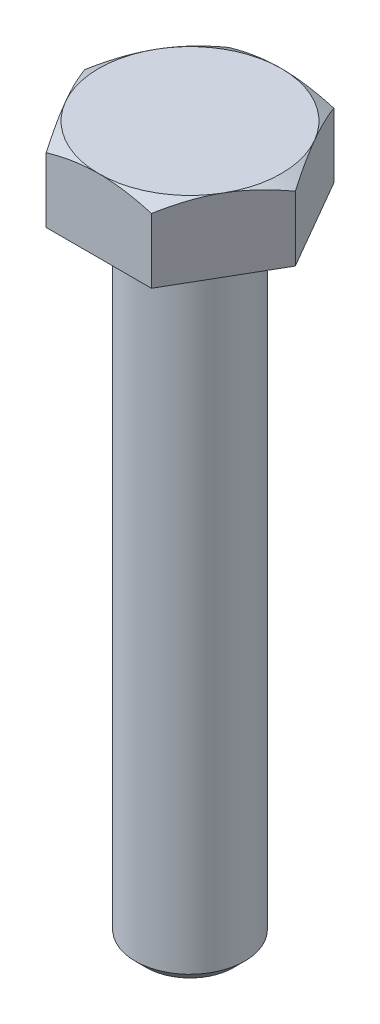
ISO-10303-21;
HEADER;
FILE_DESCRIPTION(('STEP AP214'),'2;1');
FILE_NAME('part.step','',(''),(''),'','','');
FILE_SCHEMA(('AUTOMOTIVE_DESIGN { 1 0 10303 214 1 1 1 1 }'));
ENDSEC;
DATA;
#1=APPLICATION_CONTEXT('core data for automotive mechanical design processes');
#2=APPLICATION_PROTOCOL_DEFINITION('international standard','automotive_design',2000,#1);
#3=PRODUCT_CONTEXT('',#1,'mechanical');
#4=PRODUCT('Part','Part','',(#3));
#5=PRODUCT_RELATED_PRODUCT_CATEGORY('part','',(#4));
#6=PRODUCT_DEFINITION_FORMATION('','',#4);
#7=PRODUCT_DEFINITION_CONTEXT('part definition',#1,'design');
#8=PRODUCT_DEFINITION('design','',#6,#7);
#9=PRODUCT_DEFINITION_SHAPE('','',#8);
#10=(LENGTH_UNIT() NAMED_UNIT(*) SI_UNIT(.MILLI.,.METRE.));
#11=(NAMED_UNIT(*) PLANE_ANGLE_UNIT() SI_UNIT($,.RADIAN.));
#12=(NAMED_UNIT(*) SI_UNIT($,.STERADIAN.) SOLID_ANGLE_UNIT());
#13=UNCERTAINTY_MEASURE_WITH_UNIT(LENGTH_MEASURE(1.E-05),#10,'distance_accuracy_value','');
#14=(GEOMETRIC_REPRESENTATION_CONTEXT(3) GLOBAL_UNCERTAINTY_ASSIGNED_CONTEXT((#13)) GLOBAL_UNIT_ASSIGNED_CONTEXT((#10,
#11,#12)) REPRESENTATION_CONTEXT('',''));
#15=CARTESIAN_POINT('',(0.,0.,0.));
#16=DIRECTION('',(0.,0.,1.));
#17=DIRECTION('',(1.,0.,0.));
#18=AXIS2_PLACEMENT_3D('',#15,#16,#17);
#19=CARTESIAN_POINT('',(0.,0.,0.));
#20=DIRECTION('',(0.,1.,0.));
#21=DIRECTION('',(0.,0.,1.));
#22=AXIS2_PLACEMENT_3D('',#19,#20,#21);
#23=PLANE('',#22);
#24=CARTESIAN_POINT('',(0.,0.,0.));
#25=DIRECTION('',(0.,1.,0.));
#26=DIRECTION('',(0.,0.,1.));
#27=AXIS2_PLACEMENT_3D('',#24,#25,#26);
#28=CIRCLE('',#27,3.);
#29=CARTESIAN_POINT('',(0.,0.,3.));
#30=VERTEX_POINT('',#29);
#31=EDGE_CURVE('E185',#30,#30,#28,.T.);
#32=ORIENTED_EDGE('',*,*,#31,.T.);
#33=EDGE_LOOP('',(#32));
#34=FACE_BOUND('',#33,.T.);
#35=DIRECTION('',(0.499999999999997,0.,0.86602540378444));
#36=VECTOR('',#35,1.);
#37=CARTESIAN_POINT('',(2.88675134594814,0.,-5.));
#38=LINE('',#37,#36);
#39=CARTESIAN_POINT('',(2.88675134594814,0.,-5.));
#40=VERTEX_POINT('',#39);
#41=CARTESIAN_POINT('',(5.77350269189625,0.,0.));
#42=VERTEX_POINT('',#41);
#43=EDGE_CURVE('E122',#40,#42,#38,.T.);
#44=ORIENTED_EDGE('',*,*,#43,.T.);
#45=DIRECTION('',(-0.499999999999997,0.,0.86602540378444));
#46=VECTOR('',#45,1.);
#47=CARTESIAN_POINT('',(2.88675134594814,0.,5.));
#48=LINE('',#47,#46);
#49=CARTESIAN_POINT('',(2.88675134594814,0.,5.));
#50=VERTEX_POINT('',#49);
#51=EDGE_CURVE('E120',#42,#50,#48,.T.);
#52=ORIENTED_EDGE('',*,*,#51,.T.);
#53=DIRECTION('',(-1.,0.,0.));
#54=VECTOR('',#53,1.);
#55=CARTESIAN_POINT('',(-2.88675134594814,0.,5.));
#56=LINE('',#55,#54);
#57=CARTESIAN_POINT('',(-2.88675134594814,0.,5.));
#58=VERTEX_POINT('',#57);
#59=EDGE_CURVE('E50',#50,#58,#56,.T.);
#60=ORIENTED_EDGE('',*,*,#59,.T.);
#61=DIRECTION('',(-0.499999999999997,0.,-0.86602540378444));
#62=VECTOR('',#61,1.);
#63=CARTESIAN_POINT('',(-2.88675134594814,0.,5.));
#64=LINE('',#63,#62);
#65=CARTESIAN_POINT('',(-5.77350269189626,0.,0.));
#66=VERTEX_POINT('',#65);
#67=EDGE_CURVE('E109',#58,#66,#64,.T.);
#68=ORIENTED_EDGE('',*,*,#67,.T.);
#69=DIRECTION('',(0.499999999999997,0.,-0.86602540378444));
#70=VECTOR('',#69,1.);
#71=CARTESIAN_POINT('',(-2.88675134594814,0.,-5.00000000000001));
#72=LINE('',#71,#70);
#73=CARTESIAN_POINT('',(-2.88675134594814,0.,-5.00000000000001));
#74=VERTEX_POINT('',#73);
#75=EDGE_CURVE('E115',#66,#74,#72,.T.);
#76=ORIENTED_EDGE('',*,*,#75,.T.);
#77=DIRECTION('',(1.,0.,0.));
#78=VECTOR('',#77,1.);
#79=CARTESIAN_POINT('',(-2.88675134594814,0.,-5.00000000000001));
#80=LINE('',#79,#78);
#81=EDGE_CURVE('E127',#74,#40,#80,.T.);
#82=ORIENTED_EDGE('',*,*,#81,.T.);
#83=EDGE_LOOP('',(#44,#52,#60,#68,#76,#82));
#84=FACE_BOUND('',#83,.T.);
#85=ADVANCED_FACE('F27',(#34,#84),#23,.F.);
#86=CARTESIAN_POINT('',(0.,-35.,0.));
#87=DIRECTION('',(0.,1.,0.));
#88=DIRECTION('',(0.,0.,1.));
#89=AXIS2_PLACEMENT_3D('',#86,#87,#88);
#90=CYLINDRICAL_SURFACE('',#89,3.);
#91=CARTESIAN_POINT('',(0.,-34.4,0.));
#92=DIRECTION('',(0.,1.,0.));
#93=DIRECTION('',(0.,0.,1.));
#94=AXIS2_PLACEMENT_3D('',#91,#92,#93);
#95=CIRCLE('',#94,3.);
#96=CARTESIAN_POINT('',(0.,-34.4,3.));
#97=VERTEX_POINT('',#96);
#98=EDGE_CURVE('E35',#97,#97,#95,.T.);
#99=ORIENTED_EDGE('',*,*,#98,.T.);
#100=EDGE_LOOP('',(#99));
#101=FACE_BOUND('',#100,.T.);
#102=ORIENTED_EDGE('',*,*,#31,.F.);
#103=EDGE_LOOP('',(#102));
#104=FACE_BOUND('',#103,.T.);
#105=ADVANCED_FACE('F29',(#101,#104),#90,.T.);
#106=CARTESIAN_POINT('',(0.,-35.,0.));
#107=DIRECTION('',(0.,1.,0.));
#108=DIRECTION('',(0.,0.,1.));
#109=AXIS2_PLACEMENT_3D('',#106,#107,#108);
#110=PLANE('',#109);
#111=CARTESIAN_POINT('',(0.,-35.,0.));
#112=DIRECTION('',(0.,1.,0.));
#113=DIRECTION('',(0.,0.,1.));
#114=AXIS2_PLACEMENT_3D('',#111,#112,#113);
#115=CIRCLE('',#114,2.4);
#116=CARTESIAN_POINT('',(0.,-35.,2.4));
#117=VERTEX_POINT('',#116);
#118=EDGE_CURVE('E11',#117,#117,#115,.F.);
#119=ORIENTED_EDGE('',*,*,#118,.T.);
#120=EDGE_LOOP('',(#119));
#121=FACE_BOUND('',#120,.T.);
#122=ADVANCED_FACE('F195',(#121),#110,.F.);
#123=CARTESIAN_POINT('',(0.,-34.4,0.));
#124=DIRECTION('',(0.,1.,0.));
#125=DIRECTION('',(0.,0.,1.));
#126=AXIS2_PLACEMENT_3D('',#123,#124,#125);
#127=CONICAL_SURFACE('',#126,3.,0.785398163397443);
#128=ORIENTED_EDGE('',*,*,#118,.F.);
#129=EDGE_LOOP('',(#128));
#130=FACE_BOUND('',#129,.T.);
#131=ORIENTED_EDGE('',*,*,#98,.F.);
#132=EDGE_LOOP('',(#131));
#133=FACE_BOUND('',#132,.T.);
#134=ADVANCED_FACE('F165',(#130,#133),#127,.T.);
#135=CARTESIAN_POINT('',(2.88675134594814,4.00000000000001,-5.));
#136=DIRECTION('',(0.86602540378444,0.,-0.499999999999997));
#137=DIRECTION('',(-0.499999999999997,0.,-0.86602540378444));
#138=AXIS2_PLACEMENT_3D('',#135,#136,#137);
#139=PLANE('',#138);
#140=CARTESIAN_POINT('',(2.8866358758943,3.55335134394816,-5.00019999999999));
#141=CARTESIAN_POINT('',(3.01349970319369,3.62661343236236,-4.78046540547481));
#142=CARTESIAN_POINT('',(3.1414485999385,3.6932486780819,-4.55885141554041));
#143=CARTESIAN_POINT('',(3.39956193532122,3.80956100898919,-4.11178600454648));
#144=CARTESIAN_POINT('',(3.52973095989719,3.85919695008421,-3.88632664040922));
#145=CARTESIAN_POINT('',(3.78847564779799,3.9364489745813,-3.43816769477648));
#146=CARTESIAN_POINT('',(3.91701101576053,3.96457962171651,-3.2155379068958));
#147=CARTESIAN_POINT('',(4.11026620624323,3.98980507804631,-2.88081009815335));
#148=CARTESIAN_POINT('',(4.17472868879311,3.99538654023051,-2.76915780319493));
#149=CARTESIAN_POINT('',(4.30371322717528,4.00079778324853,-2.54575002932619));
#150=CARTESIAN_POINT('',(4.3682352811059,4.0006277417418,-2.43399455370967));
#151=CARTESIAN_POINT('',(4.54500768479195,3.99224636820796,-2.12781576914935));
#152=CARTESIAN_POINT('',(4.65719946015293,3.97817022810275,-1.93349391403277));
#153=CARTESIAN_POINT('',(4.88083840557981,3.93353474289057,-1.54613989800228));
#154=CARTESIAN_POINT('',(4.9922847895602,3.90296013985249,-1.35310909862842));
#155=CARTESIAN_POINT('',(5.21637431361295,3.82653150637884,-0.964974657525136));
#156=CARTESIAN_POINT('',(5.32898917185758,3.78035362112132,-0.769920001358256));
#157=CARTESIAN_POINT('',(5.55253939626497,3.67554820550807,-0.382719654641225));
#158=CARTESIAN_POINT('',(5.66347762579591,3.61694529656263,-0.190569004591907));
#159=CARTESIAN_POINT('',(5.77361816195009,3.55335134394817,0.000200000000005751));
#160=B_SPLINE_CURVE_WITH_KNOTS('',3,(#140,#141,#142,#143,#144,#145,#146,#147,#148,#149,#150,
#151,#152,#153,#154,#155,#156,#157,#158,#159),.UNSPECIFIED.,.F.,.F.,(4,2,2,2,2,2,2,2,2,4),(0.,
0.792555841363093,1.58701660053334,2.36181537487281,2.74884076077326,3.13585419177296,
3.80962362599679,4.48401723901189,5.17336882348928,5.86136694793724),.UNSPECIFIED.);
#161=CARTESIAN_POINT('',(2.88675134594814,3.55341801261479,-5.));
#162=VERTEX_POINT('',#161);
#163=CARTESIAN_POINT('',(4.3301270189222,4.,-2.49999999999998));
#164=VERTEX_POINT('',#163);
#165=EDGE_CURVE('E174',#162,#164,#160,.T.);
#166=ORIENTED_EDGE('',*,*,#165,.T.);
#167=CARTESIAN_POINT('',(5.77350269189625,3.5534180126148,0.));
#168=VERTEX_POINT('',#167);
#169=EDGE_CURVE('E168',#164,#168,#160,.T.);
#170=ORIENTED_EDGE('',*,*,#169,.T.);
#171=DIRECTION('',(0.,-1.,0.));
#172=VECTOR('',#171,1.);
#173=CARTESIAN_POINT('',(5.77350269189625,4.,0.));
#174=LINE('',#173,#172);
#175=EDGE_CURVE('E130',#168,#42,#174,.T.);
#176=ORIENTED_EDGE('',*,*,#175,.T.);
#177=ORIENTED_EDGE('',*,*,#43,.F.);
#178=DIRECTION('',(0.,-1.,0.));
#179=VECTOR('',#178,1.);
#180=CARTESIAN_POINT('',(2.88675134594814,4.00000000000001,-5.));
#181=LINE('',#180,#179);
#182=EDGE_CURVE('E131',#162,#40,#181,.T.);
#183=ORIENTED_EDGE('',*,*,#182,.F.);
#184=EDGE_LOOP('',(#166,#170,#176,#177,#183));
#185=FACE_BOUND('',#184,.T.);
#186=ADVANCED_FACE('F161',(#185),#139,.T.);
#187=CARTESIAN_POINT('',(-2.88675134594814,4.00000000000001,-5.00000000000001));
#188=DIRECTION('',(0.,0.,-1.));
#189=DIRECTION('',(-1.,0.,0.));
#190=AXIS2_PLACEMENT_3D('',#187,#188,#189);
#191=PLANE('',#190);
#192=CARTESIAN_POINT('',(-7.76048778926928,1.55679916581875,-5.));
#193=CARTESIAN_POINT('',(-7.5420565118467,1.66278331896011,-5.00000000000001));
#194=CARTESIAN_POINT('',(-7.32312449793921,1.76775310218603,-5.00000000000001));
#195=CARTESIAN_POINT('',(-6.88399274574952,1.97509357450427,-5.00000000000001));
#196=CARTESIAN_POINT('',(-6.66379281488742,2.07746385526996,-5.00000000000001));
#197=CARTESIAN_POINT('',(-6.22072743215021,2.27954865582134,-5.00000000000001));
#198=CARTESIAN_POINT('',(-5.99785399914674,2.37924573751646,-5.00000000000001));
#199=CARTESIAN_POINT('',(-5.55033674248157,2.57456857355314,-5.00000000000001));
#200=CARTESIAN_POINT('',(-5.32569300285983,2.67019451979615,-5.00000000000001));
#201=CARTESIAN_POINT('',(-4.86699252185332,2.85930406454707,-5.00000000000001));
#202=CARTESIAN_POINT('',(-4.63286588890892,2.95261905937791,-5.00000000000001));
#203=CARTESIAN_POINT('',(-4.16187574649591,3.13220189831135,-5.00000000000001));
#204=CARTESIAN_POINT('',(-3.92501193357261,3.21846895232746,-5.00000000000001));
#205=CARTESIAN_POINT('',(-3.44861200910271,3.38169583923859,-5.00000000000001));
#206=CARTESIAN_POINT('',(-3.20908240013027,3.45867446048014,-5.00000000000001));
#207=CARTESIAN_POINT('',(-2.72658707549266,3.60085841460941,-5.00000000000001));
#208=CARTESIAN_POINT('',(-2.48362246620479,3.66606744921734,-5.));
#209=CARTESIAN_POINT('',(-1.99547492809798,3.78123809132251,-5.));
#210=CARTESIAN_POINT('',(-1.7503120052408,3.83128293361866,-5.00000000000001));
#211=CARTESIAN_POINT('',(-1.25693040330865,3.91330313759114,-5.00000000000001));
#212=CARTESIAN_POINT('',(-1.00871201664547,3.94528021484797,-5.00000000000001));
#213=CARTESIAN_POINT('',(-0.513703870190963,3.98819571375164,-5.00000000000001));
#214=CARTESIAN_POINT('',(-0.266938190301912,3.99940504145542,-5.00000000000001));
#215=CARTESIAN_POINT('',(0.226662621341122,4.00054813207997,-5.));
#216=CARTESIAN_POINT('',(0.47349775423874,3.9904815213461,-4.99999999999999));
#217=CARTESIAN_POINT('',(0.892367264144084,3.95605849611754,-4.99999999999999));
#218=CARTESIAN_POINT('',(1.06484900611664,3.93683281467063,-5.));
#219=CARTESIAN_POINT('',(1.40854643072639,3.88918623589597,-5.00000000000001));
#220=CARTESIAN_POINT('',(1.57976193868589,3.86076409325046,-5.00000000000001));
#221=CARTESIAN_POINT('',(2.09128374091837,3.763197156301,-5.00000000000001));
#222=CARTESIAN_POINT('',(2.42927319835488,3.68176973611523,-5.00000000000001));
#223=CARTESIAN_POINT('',(2.93465289665546,3.54061970789696,-5.00000000000001));
#224=CARTESIAN_POINT('',(3.10466426762807,3.48974775564269,-5.00000000000001));
#225=CARTESIAN_POINT('',(3.44303543484803,3.38273154853344,-5.00000000000001));
#226=CARTESIAN_POINT('',(3.61139522026247,3.32658725912223,-5.00000000000001));
#227=CARTESIAN_POINT('',(3.94651663548223,3.20992638126615,-5.00000000000001));
#228=CARTESIAN_POINT('',(4.11327877489048,3.14941124341302,-5.00000000000001));
#229=CARTESIAN_POINT('',(4.44542232252997,3.02471944648924,-5.00000000000001));
#230=CARTESIAN_POINT('',(4.6108037462888,2.96054282865949,-5.));
#231=CARTESIAN_POINT('',(4.9983678843583,2.80599622987765,-5.));
#232=CARTESIAN_POINT('',(5.22004493155315,2.714360568402,-5.00000000000001));
#233=CARTESIAN_POINT('',(5.66153030335629,2.52668097806057,-5.00000000000001));
#234=CARTESIAN_POINT('',(5.88133851780496,2.43063679143738,-5.00000000000001));
#235=CARTESIAN_POINT('',(6.31942671713667,2.23501814306471,-5.00000000000001));
#236=CARTESIAN_POINT('',(6.53770638957655,2.13544298341336,-5.00000000000001));
#237=CARTESIAN_POINT('',(6.97295214936624,1.93345780770434,-5.00000000000001));
#238=CARTESIAN_POINT('',(7.18991820890859,1.83104773188916,-5.00000000000001));
#239=CARTESIAN_POINT('',(7.83959406167255,1.52018400970472,-5.00000000000001));
#240=CARTESIAN_POINT('',(8.27065630656694,1.30828938790695,-5.00000000000001));
#241=CARTESIAN_POINT('',(9.12966564235016,0.878278075997001,-5.00000000000001));
#242=CARTESIAN_POINT('',(9.55761261856338,0.660161158276192,-5.00000000000001));
#243=CARTESIAN_POINT('',(10.1800967721103,0.338805868079967,-5.00000000000001));
#244=CARTESIAN_POINT('',(10.3755404122209,0.2373182183117,-5.00000000000001));
#245=CARTESIAN_POINT('',(10.7660006843461,0.0335333766308003,-5.00000000000001));
#246=CARTESIAN_POINT('',(10.9610173241066,-0.0687638004388765,-5.00000000000001));
#247=CARTESIAN_POINT('',(11.545529921535,-0.376714641942765,-5.00000000000001));
#248=CARTESIAN_POINT('',(11.9344722683259,-0.583419183869823,-5.00000000000001));
#249=CARTESIAN_POINT('',(12.7102557093995,-0.998453048036567,-5.00000000000001));
#250=CARTESIAN_POINT('',(13.0970996194284,-1.20677711692846,-5.00000000000001));
#251=CARTESIAN_POINT('',(13.8698511096838,-1.62510517694811,-5.00000000000001));
#252=CARTESIAN_POINT('',(14.2557587399382,-1.83510907562157,-5.));
#253=CARTESIAN_POINT('',(14.6413209053525,-2.04574136052357,-4.99999999999999));
#254=B_SPLINE_CURVE_WITH_KNOTS('',3,(#192,#193,#194,#195,#196,#197,#198,#199,#200,#201,#202,
#203,#204,#205,#206,#207,#208,#209,#210,#211,#212,#213,#214,#215,#216,#217,#218,#219,#220,#221,
#222,#223,#224,#225,#226,#227,#228,#229,#230,#231,#232,#233,#234,#235,#236,#237,#238,#239,#240,
#241,#242,#243,#244,#245,#246,#247,#248,#249,#250,#251,#252,#253),.UNSPECIFIED.,.F.,.F.,(4,2,2,
2,2,2,2,2,2,2,2,2,2,2,2,2,2,2,2,2,2,2,2,2,2,2,2,2,2,2,4),(0.,0.728365768559899,1.45684524890932,
2.18928016612498,2.92168052018108,3.67770572085789,4.43381555732172,5.18836936553261,
5.94268543957441,6.69278284280357,7.44280901039121,8.18298060384632,8.92316519653325,
9.44356259764435,9.96403049669095,11.0055425058991,11.5378755676847,12.0702121187586,
12.602372803317,13.1345274950934,13.8540746977697,14.573664024613,15.2933963808733,
16.0131439200198,17.4540389903029,18.8949868355966,19.5556528539249,20.2163067866563,
21.5376696779227,22.8557792684195,24.1738168053778),.UNSPECIFIED.);
#255=CARTESIAN_POINT('',(-2.88675134594814,3.55341801261479,-5.00000000000001));
#256=VERTEX_POINT('',#255);
#257=CARTESIAN_POINT('',(0.,4.00000000000001,-5.00000000000001));
#258=VERTEX_POINT('',#257);
#259=EDGE_CURVE('E175',#256,#258,#254,.T.);
#260=ORIENTED_EDGE('',*,*,#259,.T.);
#261=EDGE_CURVE('E176',#258,#162,#254,.T.);
#262=ORIENTED_EDGE('',*,*,#261,.T.);
#263=ORIENTED_EDGE('',*,*,#182,.T.);
#264=ORIENTED_EDGE('',*,*,#81,.F.);
#265=DIRECTION('',(0.,-1.,0.));
#266=VECTOR('',#265,1.);
#267=CARTESIAN_POINT('',(-2.88675134594814,4.00000000000001,-5.00000000000001));
#268=LINE('',#267,#266);
#269=EDGE_CURVE('E134',#256,#74,#268,.T.);
#270=ORIENTED_EDGE('',*,*,#269,.F.);
#271=EDGE_LOOP('',(#260,#262,#263,#264,#270));
#272=FACE_BOUND('',#271,.T.);
#273=ADVANCED_FACE('F164',(#272),#191,.T.);
#274=CARTESIAN_POINT('',(-2.88675134594814,4.00000000000001,-5.00000000000001));
#275=DIRECTION('',(-0.86602540378444,0.,-0.499999999999997));
#276=DIRECTION('',(-0.499999999999997,0.,0.86602540378444));
#277=AXIS2_PLACEMENT_3D('',#274,#275,#276);
#278=PLANE('',#277);
#279=CARTESIAN_POINT('',(-5.77361816195008,3.55335134394823,0.000200000000005751));
#280=CARTESIAN_POINT('',(-5.64675433465069,3.62661343236239,-0.219534594525189));
#281=CARTESIAN_POINT('',(-5.51880543790589,3.69324867808192,-0.441148584459588));
#282=CARTESIAN_POINT('',(-5.26069210252317,3.80956100898918,-0.888213995453521));
#283=CARTESIAN_POINT('',(-5.13052307794721,3.85919695008421,-1.11367335959078));
#284=CARTESIAN_POINT('',(-4.87177839004641,3.9364489745813,-1.56183230522351));
#285=CARTESIAN_POINT('',(-4.74324302208387,3.96457962171651,-1.78446209310419));
#286=CARTESIAN_POINT('',(-4.54998783160116,3.98980507804631,-2.11918990184664));
#287=CARTESIAN_POINT('',(-4.48552534905128,3.99538654023051,-2.23084219680506));
#288=CARTESIAN_POINT('',(-4.35654081066911,4.00079778324853,-2.4542499706738));
#289=CARTESIAN_POINT('',(-4.2920187567385,4.0006277417418,-2.56600544629031));
#290=CARTESIAN_POINT('',(-4.11524635305245,3.99224636820796,-2.87218423085064));
#291=CARTESIAN_POINT('',(-4.00305457769147,3.97817022810274,-3.06650608596721));
#292=CARTESIAN_POINT('',(-3.77941563226458,3.93353474289056,-3.45386010199771));
#293=CARTESIAN_POINT('',(-3.66796924828419,3.90296013985248,-3.64689090137158));
#294=CARTESIAN_POINT('',(-3.44387972423144,3.82653150637883,-4.03502534247486));
#295=CARTESIAN_POINT('',(-3.33126486598681,3.78035362112131,-4.23007999864174));
#296=CARTESIAN_POINT('',(-3.10771464157941,3.67554820550806,-4.61728034535878));
#297=CARTESIAN_POINT('',(-2.99677641204848,3.61694529656262,-4.8094309954081));
#298=CARTESIAN_POINT('',(-2.8866358758943,3.55335134394816,-5.00020000000001));
#299=B_SPLINE_CURVE_WITH_KNOTS('',3,(#279,#280,#281,#282,#283,#284,#285,#286,#287,#288,#289,
#290,#291,#292,#293,#294,#295,#296,#297,#298),.UNSPECIFIED.,.F.,.F.,(4,2,2,2,2,2,2,2,2,4),(0.,
0.792555841363082,1.58701660053332,2.36181537487279,2.74884076077323,3.13585419177293,
3.80962362599677,4.48401723901187,5.17336882348927,5.86136694793724),.UNSPECIFIED.);
#300=CARTESIAN_POINT('',(-5.77350269189626,3.55341801261486,0.));
#301=VERTEX_POINT('',#300);
#302=CARTESIAN_POINT('',(-4.3301270189222,4.,-2.49999999999998));
#303=VERTEX_POINT('',#302);
#304=EDGE_CURVE('E277',#301,#303,#299,.T.);
#305=ORIENTED_EDGE('',*,*,#304,.T.);
#306=EDGE_CURVE('E273',#303,#256,#299,.T.);
#307=ORIENTED_EDGE('',*,*,#306,.T.);
#308=ORIENTED_EDGE('',*,*,#269,.T.);
#309=ORIENTED_EDGE('',*,*,#75,.F.);
#310=DIRECTION('',(0.,-1.,0.));
#311=VECTOR('',#310,1.);
#312=CARTESIAN_POINT('',(-5.77350269189626,4.00000000000007,0.));
#313=LINE('',#312,#311);
#314=EDGE_CURVE('E105',#301,#66,#313,.T.);
#315=ORIENTED_EDGE('',*,*,#314,.F.);
#316=EDGE_LOOP('',(#305,#307,#308,#309,#315));
#317=FACE_BOUND('',#316,.T.);
#318=ADVANCED_FACE('F251',(#317),#278,.T.);
#319=CARTESIAN_POINT('',(-2.88675134594814,4.,5.));
#320=DIRECTION('',(-0.86602540378444,0.,0.499999999999997));
#321=DIRECTION('',(0.499999999999997,0.,0.86602540378444));
#322=AXIS2_PLACEMENT_3D('',#319,#320,#321);
#323=PLANE('',#322);
#324=CARTESIAN_POINT('',(-2.8866358758943,3.55335134394817,5.00019999999999));
#325=CARTESIAN_POINT('',(-3.01349970319369,3.62661343236237,4.78046540547481));
#326=CARTESIAN_POINT('',(-3.1414485999385,3.69324867808191,4.55885141554041));
#327=CARTESIAN_POINT('',(-3.39956193532122,3.80956100898919,4.11178600454648));
#328=CARTESIAN_POINT('',(-3.52973095989719,3.85919695008421,3.88632664040921));
#329=CARTESIAN_POINT('',(-3.78847564779799,3.9364489745813,3.43816769477647));
#330=CARTESIAN_POINT('',(-3.91701101576053,3.96457962171652,3.21553790689579));
#331=CARTESIAN_POINT('',(-4.11026620624323,3.98980507804631,2.88081009815334));
#332=CARTESIAN_POINT('',(-4.17472868879311,3.9953865402305,2.76915780319492));
#333=CARTESIAN_POINT('',(-4.30371322717528,4.00079778324854,2.54575002932619));
#334=CARTESIAN_POINT('',(-4.3682352811059,4.00062774174185,2.43399455370967));
#335=CARTESIAN_POINT('',(-4.54500768479195,3.99224636820804,2.12781576914935));
#336=CARTESIAN_POINT('',(-4.65719946015292,3.97817022810277,1.93349391403278));
#337=CARTESIAN_POINT('',(-4.8808384055798,3.93353474289055,1.54613989800229));
#338=CARTESIAN_POINT('',(-4.99228478956019,3.90296013985249,1.35310909862843));
#339=CARTESIAN_POINT('',(-5.21637431361294,3.82653150637884,0.964974657525147));
#340=CARTESIAN_POINT('',(-5.32898917185758,3.78035362112132,0.769920001358267));
#341=CARTESIAN_POINT('',(-5.55253939626497,3.67554820550807,0.382719654641234));
#342=CARTESIAN_POINT('',(-5.6634776257959,3.61694529656264,0.190569004591914));
#343=CARTESIAN_POINT('',(-5.77361816195008,3.55335134394823,-0.000200000000005751));
#344=B_SPLINE_CURVE_WITH_KNOTS('',3,(#324,#325,#326,#327,#328,#329,#330,#331,#332,#333,#334,
#335,#336,#337,#338,#339,#340,#341,#342,#343),.UNSPECIFIED.,.F.,.F.,(4,2,2,2,2,2,2,2,2,4),(0.,
0.792555841363086,1.58701660053334,2.36181537487281,2.74884076077326,3.13585419177295,
3.80962362599678,4.48401723901187,5.17336882348927,5.86136694793722),.UNSPECIFIED.);
#345=CARTESIAN_POINT('',(-2.88675134594814,3.55341801261479,5.));
#346=VERTEX_POINT('',#345);
#347=CARTESIAN_POINT('',(-4.3301270189222,4.00000000000007,2.49999999999999));
#348=VERTEX_POINT('',#347);
#349=EDGE_CURVE('E271',#346,#348,#344,.T.);
#350=ORIENTED_EDGE('',*,*,#349,.T.);
#351=EDGE_CURVE('E267',#348,#301,#344,.T.);
#352=ORIENTED_EDGE('',*,*,#351,.T.);
#353=ORIENTED_EDGE('',*,*,#314,.T.);
#354=ORIENTED_EDGE('',*,*,#67,.F.);
#355=DIRECTION('',(0.,-1.,0.));
#356=VECTOR('',#355,1.);
#357=CARTESIAN_POINT('',(-2.88675134594814,4.,5.));
#358=LINE('',#357,#356);
#359=EDGE_CURVE('E98',#346,#58,#358,.T.);
#360=ORIENTED_EDGE('',*,*,#359,.F.);
#361=EDGE_LOOP('',(#350,#352,#353,#354,#360));
#362=FACE_BOUND('',#361,.T.);
#363=ADVANCED_FACE('F110',(#362),#323,.T.);
#364=CARTESIAN_POINT('',(-2.88675134594814,4.,5.));
#365=DIRECTION('',(0.,0.,1.));
#366=DIRECTION('',(1.,0.,0.));
#367=AXIS2_PLACEMENT_3D('',#364,#365,#366);
#368=PLANE('',#367);
#369=CARTESIAN_POINT('',(-7.76048778906704,1.55679916591691,5.));
#370=CARTESIAN_POINT('',(-7.54205651165125,1.66278331905416,5.));
#371=CARTESIAN_POINT('',(-7.32312449775056,1.76775310227598,5.));
#372=CARTESIAN_POINT('',(-6.88399274557448,1.97509357458603,4.99999999999999));
#373=CARTESIAN_POINT('',(-6.66379281471921,2.07746385534764,5.));
#374=CARTESIAN_POINT('',(-6.22072743199574,2.27954865589085,5.));
#375=CARTESIAN_POINT('',(-5.9978539989992,2.37924573758188,5.));
#376=CARTESIAN_POINT('',(-5.55033674234793,2.57456857361045,5.));
#377=CARTESIAN_POINT('',(-5.32569300273317,2.67019451984945,5.));
#378=CARTESIAN_POINT('',(-4.86699252174113,2.85930406459222,5.));
#379=CARTESIAN_POINT('',(-4.63286588880424,2.95261905941894,5.));
#380=CARTESIAN_POINT('',(-4.16187574640634,3.13220189834438,5.));
#381=CARTESIAN_POINT('',(-3.92501193349067,3.21846895235661,5.));
#382=CARTESIAN_POINT('',(-3.44861200903616,3.38169583926033,5.));
#383=CARTESIAN_POINT('',(-3.20908240007148,3.45867446049837,4.99999999999999));
#384=CARTESIAN_POINT('',(-2.72658707544962,3.6008584146212,5.));
#385=CARTESIAN_POINT('',(-2.48362246616972,3.66606744922619,5.));
#386=CARTESIAN_POINT('',(-1.99547492808302,3.78123809132547,5.));
#387=CARTESIAN_POINT('',(-1.75031200523802,3.83128293361889,5.));
#388=CARTESIAN_POINT('',(-1.25693040333053,3.91330313758775,4.99999999999999));
#389=CARTESIAN_POINT('',(-1.00871201667982,3.9452802148437,5.));
#390=CARTESIAN_POINT('',(-0.513703870250041,3.98819571374781,5.));
#391=CARTESIAN_POINT('',(-0.266938190373247,3.99940504145288,4.99999999999999));
#392=CARTESIAN_POINT('',(0.226662621245472,4.00054813208214,5.));
#393=CARTESIAN_POINT('',(0.47349775413103,3.99048152135167,5.00000000000002));
#394=CARTESIAN_POINT('',(0.892367264021111,3.95605849612997,5.00000000000001));
#395=CARTESIAN_POINT('',(1.06484900599032,3.9368328146858,5.));
#396=CARTESIAN_POINT('',(1.40854643059355,3.88918623591675,4.99999999999999));
#397=CARTESIAN_POINT('',(1.57976193854985,3.86076409327412,5.));
#398=CARTESIAN_POINT('',(2.09128374077292,3.76319715633336,5.));
#399=CARTESIAN_POINT('',(2.42927319820339,3.68176973615346,5.));
#400=CARTESIAN_POINT('',(2.93465289649495,3.54061970794389,5.));
#401=CARTESIAN_POINT('',(3.10466426746449,3.48974775569253,5.));
#402=CARTESIAN_POINT('',(3.44303543467834,3.38273154858902,5.));
#403=CARTESIAN_POINT('',(3.61139522008974,3.32658725918064,5.));
#404=CARTESIAN_POINT('',(3.94651663530345,3.20992638133011,5.));
#405=CARTESIAN_POINT('',(4.11327877470868,3.14941124347971,5.));
#406=CARTESIAN_POINT('',(4.44542232234215,3.02471944656131,5.));
#407=CARTESIAN_POINT('',(4.61080374609796,2.9605428287342,5.));
#408=CARTESIAN_POINT('',(4.99836788416536,2.80599622995648,5.00000000000001));
#409=CARTESIAN_POINT('',(5.22004493136108,2.71436056848215,5.));
#410=CARTESIAN_POINT('',(5.66153030316585,2.52668097814304,5.));
#411=CARTESIAN_POINT('',(5.88133851761528,2.43063679152086,5.));
#412=CARTESIAN_POINT('',(6.31942671694845,2.23501814314998,5.));
#413=CARTESIAN_POINT('',(6.53770638938902,2.13544298349941,5.));
#414=CARTESIAN_POINT('',(6.97295214918001,1.93345780779175,5.));
#415=CARTESIAN_POINT('',(7.18991820872298,1.83104773197717,5.));
#416=CARTESIAN_POINT('',(7.83959406148875,1.52018400979429,5.));
#417=CARTESIAN_POINT('',(8.27065630638426,1.30828938799729,5.));
#418=CARTESIAN_POINT('',(9.12966564216956,0.878278076088522,5.));
#419=CARTESIAN_POINT('',(9.55761261838374,0.66016115836814,5.));
#420=CARTESIAN_POINT('',(10.1800967719317,0.338805868172548,5.));
#421=CARTESIAN_POINT('',(10.3755404120423,0.237318218404574,5.));
#422=CARTESIAN_POINT('',(10.7660006841677,0.0335333767242246,5.));
#423=CARTESIAN_POINT('',(10.9610173239282,-0.0687638003451939,5.));
#424=CARTESIAN_POINT('',(11.5455299213569,-0.376714641848353,5.));
#425=CARTESIAN_POINT('',(11.9344722681479,-0.583419183774983,5.));
#426=CARTESIAN_POINT('',(12.7102557092215,-0.998453047940895,5.));
#427=CARTESIAN_POINT('',(13.0970996192503,-1.20677711683239,5.));
#428=CARTESIAN_POINT('',(13.8698511095056,-1.62510517685128,5.));
#429=CARTESIAN_POINT('',(14.2557587397599,-1.83510907552439,5.));
#430=CARTESIAN_POINT('',(14.641320905174,-2.04574136042606,5.00000000000001));
#431=B_SPLINE_CURVE_WITH_KNOTS('',3,(#369,#370,#371,#372,#373,#374,#375,#376,#377,#378,#379,
#380,#381,#382,#383,#384,#385,#386,#387,#388,#389,#390,#391,#392,#393,#394,#395,#396,#397,#398,
#399,#400,#401,#402,#403,#404,#405,#406,#407,#408,#409,#410,#411,#412,#413,#414,#415,#416,#417,
#418,#419,#420,#421,#422,#423,#424,#425,#426,#427,#428,#429,#430),.UNSPECIFIED.,.F.,.F.,(4,2,2,
2,2,2,2,2,2,2,2,2,2,2,2,2,2,2,2,2,2,2,2,2,2,2,2,2,2,2,4),(0.,0.728365768536184,1.45684524886189,
2.18928016605357,2.92168052008569,3.67770572073703,4.43381555717539,5.18836936536089,
5.94268543937733,6.69278284256911,7.44280901011943,8.18298060353813,8.92316519618862,
9.44356259728886,9.96403049632459,11.005542505511,11.5378755672852,12.0702121183478,
12.6023728028949,13.13452749466,13.8540746973372,14.5736640241814,15.2933963804426,
16.01314391959,17.454038989875,18.8949868351707,19.5556528534989,20.2163067862301,
21.5376696774962,22.8557792679922,24.1738168049497),.UNSPECIFIED.);
#432=CARTESIAN_POINT('',(2.88675134594814,3.55341801261479,5.));
#433=VERTEX_POINT('',#432);
#434=CARTESIAN_POINT('',(0.,4.,5.));
#435=VERTEX_POINT('',#434);
#436=EDGE_CURVE('E272',#433,#435,#431,.F.);
#437=ORIENTED_EDGE('',*,*,#436,.T.);
#438=EDGE_CURVE('E102',#435,#346,#431,.F.);
#439=ORIENTED_EDGE('',*,*,#438,.T.);
#440=ORIENTED_EDGE('',*,*,#359,.T.);
#441=ORIENTED_EDGE('',*,*,#59,.F.);
#442=DIRECTION('',(0.,-1.,0.));
#443=VECTOR('',#442,1.);
#444=CARTESIAN_POINT('',(2.88675134594814,4.,5.));
#445=LINE('',#444,#443);
#446=EDGE_CURVE('E106',#433,#50,#445,.T.);
#447=ORIENTED_EDGE('',*,*,#446,.F.);
#448=EDGE_LOOP('',(#437,#439,#440,#441,#447));
#449=FACE_BOUND('',#448,.T.);
#450=ADVANCED_FACE('F100',(#449),#368,.T.);
#451=CARTESIAN_POINT('',(2.88675134594814,4.,5.));
#452=DIRECTION('',(0.86602540378444,0.,0.499999999999997));
#453=DIRECTION('',(0.499999999999997,0.,-0.86602540378444));
#454=AXIS2_PLACEMENT_3D('',#451,#452,#453);
#455=PLANE('',#454);
#456=CARTESIAN_POINT('',(5.77361816195009,3.55335134394817,-0.000200000000005751));
#457=CARTESIAN_POINT('',(5.6467543346507,3.62661343236237,0.219534594525181));
#458=CARTESIAN_POINT('',(5.51880543790589,3.69324867808191,0.441148584459577));
#459=CARTESIAN_POINT('',(5.26069210252317,3.80956100898919,0.888213995453513));
#460=CARTESIAN_POINT('',(5.1305230779472,3.85919695008421,1.11367335959078));
#461=CARTESIAN_POINT('',(4.8717783900464,3.93644897458131,1.56183230522352));
#462=CARTESIAN_POINT('',(4.74324302208386,3.96457962171652,1.7844620931042));
#463=CARTESIAN_POINT('',(4.54998783160116,3.98980507804631,2.11918990184665));
#464=CARTESIAN_POINT('',(4.48552534905128,3.9953865402305,2.23084219680507));
#465=CARTESIAN_POINT('',(4.35654081066911,4.00079778324854,2.4542499706738));
#466=CARTESIAN_POINT('',(4.2920187567385,4.00062774174185,2.56600544629032));
#467=CARTESIAN_POINT('',(4.11524635305244,3.99224636820805,2.87218423085064));
#468=CARTESIAN_POINT('',(4.00305457769147,3.97817022810277,3.06650608596721));
#469=CARTESIAN_POINT('',(3.77941563226458,3.93353474289054,3.4538601019977));
#470=CARTESIAN_POINT('',(3.66796924828419,3.90296013985248,3.64689090137156));
#471=CARTESIAN_POINT('',(3.44387972423145,3.82653150637884,4.03502534247485));
#472=CARTESIAN_POINT('',(3.33126486598681,3.78035362112132,4.23007999864173));
#473=CARTESIAN_POINT('',(3.10771464157942,3.67554820550806,4.61728034535877));
#474=CARTESIAN_POINT('',(2.99677641204848,3.61694529656261,4.80943099540808));
#475=CARTESIAN_POINT('',(2.8866358758943,3.55335134394817,5.0002));
#476=B_SPLINE_CURVE_WITH_KNOTS('',3,(#456,#457,#458,#459,#460,#461,#462,#463,#464,#465,#466,
#467,#468,#469,#470,#471,#472,#473,#474,#475),.UNSPECIFIED.,.F.,.F.,(4,2,2,2,2,2,2,2,2,4),(0.,
0.792555841363089,1.58701660053334,2.36181537487281,2.74884076077326,3.13585419177295,
3.80962362599679,4.48401723901188,5.17336882348928,5.86136694793725),.UNSPECIFIED.);
#477=CARTESIAN_POINT('',(4.3301270189222,4.00000000000007,2.49999999999999));
#478=VERTEX_POINT('',#477);
#479=EDGE_CURVE('E42',#168,#478,#476,.T.);
#480=ORIENTED_EDGE('',*,*,#479,.T.);
#481=EDGE_CURVE('E133',#478,#433,#476,.T.);
#482=ORIENTED_EDGE('',*,*,#481,.T.);
#483=ORIENTED_EDGE('',*,*,#446,.T.);
#484=ORIENTED_EDGE('',*,*,#51,.F.);
#485=ORIENTED_EDGE('',*,*,#175,.F.);
#486=EDGE_LOOP('',(#480,#482,#483,#484,#485));
#487=FACE_BOUND('',#486,.T.);
#488=ADVANCED_FACE('F154',(#487),#455,.T.);
#489=CARTESIAN_POINT('',(0.,2.80426844130949,0.));
#490=DIRECTION('',(0.,-1.,0.));
#491=DIRECTION('',(0.,0.,-1.));
#492=AXIS2_PLACEMENT_3D('',#489,#490,#491);
#493=CONICAL_SURFACE('',#492,7.07106781186548,1.0471975511966);
#494=ORIENTED_EDGE('',*,*,#349,.F.);
#495=ORIENTED_EDGE('',*,*,#438,.F.);
#496=CARTESIAN_POINT('',(0.,4.,0.));
#497=DIRECTION('',(0.,1.,0.));
#498=DIRECTION('',(0.,0.,1.));
#499=AXIS2_PLACEMENT_3D('',#496,#497,#498);
#500=CIRCLE('',#499,5.);
#501=EDGE_CURVE('E187',#348,#435,#500,.T.);
#502=ORIENTED_EDGE('',*,*,#501,.F.);
#503=EDGE_LOOP('',(#494,#495,#502));
#504=FACE_BOUND('',#503,.T.);
#505=ADVANCED_FACE('F158',(#504),#493,.T.);
#506=ORIENTED_EDGE('',*,*,#304,.F.);
#507=ORIENTED_EDGE('',*,*,#351,.F.);
#508=EDGE_CURVE('E285',#303,#348,#500,.T.);
#509=ORIENTED_EDGE('',*,*,#508,.F.);
#510=EDGE_LOOP('',(#506,#507,#509));
#511=FACE_BOUND('',#510,.T.);
#512=ADVANCED_FACE('F150',(#511),#493,.T.);
#513=ORIENTED_EDGE('',*,*,#306,.F.);
#514=EDGE_CURVE('E292',#258,#303,#500,.T.);
#515=ORIENTED_EDGE('',*,*,#514,.F.);
#516=ORIENTED_EDGE('',*,*,#259,.F.);
#517=EDGE_LOOP('',(#513,#515,#516));
#518=FACE_BOUND('',#517,.T.);
#519=ADVANCED_FACE('F236',(#518),#493,.T.);
#520=ORIENTED_EDGE('',*,*,#261,.F.);
#521=EDGE_CURVE('E293',#164,#258,#500,.T.);
#522=ORIENTED_EDGE('',*,*,#521,.F.);
#523=ORIENTED_EDGE('',*,*,#165,.F.);
#524=EDGE_LOOP('',(#520,#522,#523));
#525=FACE_BOUND('',#524,.T.);
#526=ADVANCED_FACE('F227',(#525),#493,.T.);
#527=ORIENTED_EDGE('',*,*,#169,.F.);
#528=EDGE_CURVE('E186',#478,#164,#500,.T.);
#529=ORIENTED_EDGE('',*,*,#528,.F.);
#530=ORIENTED_EDGE('',*,*,#479,.F.);
#531=EDGE_LOOP('',(#527,#529,#530));
#532=FACE_BOUND('',#531,.T.);
#533=ADVANCED_FACE('F223',(#532),#493,.T.);
#534=CARTESIAN_POINT('',(0.,4.,0.));
#535=DIRECTION('',(0.,-1.,0.));
#536=DIRECTION('',(0.,0.,-1.));
#537=AXIS2_PLACEMENT_3D('',#534,#535,#536);
#538=PLANE('',#537);
#539=EDGE_CURVE('E182',#435,#478,#500,.T.);
#540=ORIENTED_EDGE('',*,*,#539,.T.);
#541=ORIENTED_EDGE('',*,*,#528,.T.);
#542=ORIENTED_EDGE('',*,*,#521,.T.);
#543=ORIENTED_EDGE('',*,*,#514,.T.);
#544=ORIENTED_EDGE('',*,*,#508,.T.);
#545=ORIENTED_EDGE('',*,*,#501,.T.);
#546=EDGE_LOOP('',(#540,#541,#542,#543,#544,#545));
#547=FACE_BOUND('',#546,.T.);
#548=ADVANCED_FACE('F215',(#547),#538,.F.);
#549=ORIENTED_EDGE('',*,*,#436,.F.);
#550=ORIENTED_EDGE('',*,*,#481,.F.);
#551=ORIENTED_EDGE('',*,*,#539,.F.);
#552=EDGE_LOOP('',(#549,#550,#551));
#553=FACE_BOUND('',#552,.T.);
#554=ADVANCED_FACE('F218',(#553),#493,.T.);
#555=CLOSED_SHELL('',(#85,#105,#122,#134,#186,#273,#318,#363,#450,#488,#505,#512,#519,#526,#533,
#548,#554));
#556=MANIFOLD_SOLID_BREP('B2',#555);
#557=ADVANCED_BREP_SHAPE_REPRESENTATION('',(#18,#556),#14);
#558=SHAPE_DEFINITION_REPRESENTATION(#9,#557);
ENDSEC;
END-ISO-10303-21;
